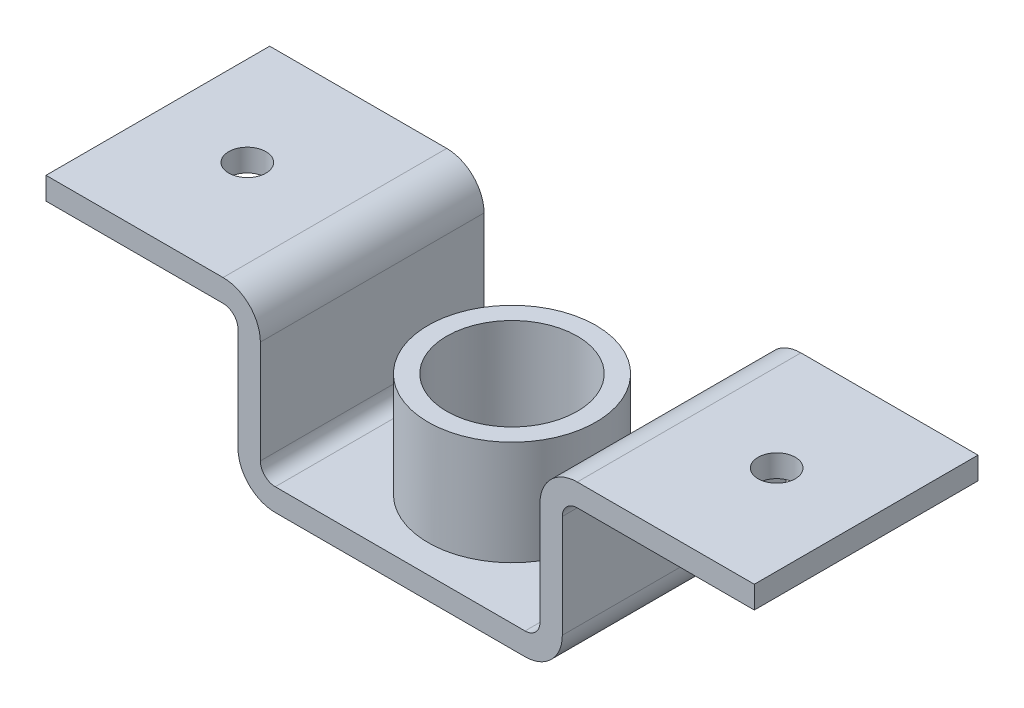
ISO-10303-21;
HEADER;
FILE_DESCRIPTION(('STEP AP214'),'2;1');
FILE_NAME('part.step','',(''),(''),'','','');
FILE_SCHEMA(('AUTOMOTIVE_DESIGN { 1 0 10303 214 1 1 1 1 }'));
ENDSEC;
DATA;
#1=APPLICATION_CONTEXT('core data for automotive mechanical design processes');
#2=APPLICATION_PROTOCOL_DEFINITION('international standard','automotive_design',2000,#1);
#3=PRODUCT_CONTEXT('',#1,'mechanical');
#4=PRODUCT('Part','Part','',(#3));
#5=PRODUCT_RELATED_PRODUCT_CATEGORY('part','',(#4));
#6=PRODUCT_DEFINITION_FORMATION('','',#4);
#7=PRODUCT_DEFINITION_CONTEXT('part definition',#1,'design');
#8=PRODUCT_DEFINITION('design','',#6,#7);
#9=PRODUCT_DEFINITION_SHAPE('','',#8);
#10=(LENGTH_UNIT() NAMED_UNIT(*) SI_UNIT(.MILLI.,.METRE.));
#11=(NAMED_UNIT(*) PLANE_ANGLE_UNIT() SI_UNIT($,.RADIAN.));
#12=(NAMED_UNIT(*) SI_UNIT($,.STERADIAN.) SOLID_ANGLE_UNIT());
#13=UNCERTAINTY_MEASURE_WITH_UNIT(LENGTH_MEASURE(1.E-05),#10,'distance_accuracy_value','');
#14=(GEOMETRIC_REPRESENTATION_CONTEXT(3) GLOBAL_UNCERTAINTY_ASSIGNED_CONTEXT((#13)) GLOBAL_UNIT_ASSIGNED_CONTEXT((#10,
#11,#12)) REPRESENTATION_CONTEXT('',''));
#15=CARTESIAN_POINT('',(0.,0.,0.));
#16=DIRECTION('',(0.,0.,1.));
#17=DIRECTION('',(1.,0.,0.));
#18=AXIS2_PLACEMENT_3D('',#15,#16,#17);
#19=CARTESIAN_POINT('',(167.5,49.9999999999999,300.));
#20=DIRECTION('',(0.,0.,-1.));
#21=DIRECTION('',(-1.,0.,0.));
#22=AXIS2_PLACEMENT_3D('',#19,#20,#21);
#23=CYLINDRICAL_SURFACE('',#22,20.);
#24=CARTESIAN_POINT('',(167.5,49.9999999999999,0.));
#25=DIRECTION('',(0.,0.,-1.));
#26=DIRECTION('',(-1.,0.,0.));
#27=AXIS2_PLACEMENT_3D('',#24,#25,#26);
#28=CIRCLE('',#27,20.);
#29=CARTESIAN_POINT('',(187.5,50.0000000000001,0.));
#30=VERTEX_POINT('',#29);
#31=CARTESIAN_POINT('',(167.5,29.9999999999999,0.));
#32=VERTEX_POINT('',#31);
#33=EDGE_CURVE('E208',#30,#32,#28,.T.);
#34=ORIENTED_EDGE('',*,*,#33,.T.);
#35=DIRECTION('',(0.,0.,-1.));
#36=VECTOR('',#35,1.);
#37=CARTESIAN_POINT('',(167.5,29.9999999999999,300.));
#38=LINE('',#37,#36);
#39=CARTESIAN_POINT('',(167.5,29.9999999999999,300.));
#40=VERTEX_POINT('',#39);
#41=EDGE_CURVE('E46',#40,#32,#38,.T.);
#42=ORIENTED_EDGE('',*,*,#41,.F.);
#43=CARTESIAN_POINT('',(167.5,49.9999999999999,300.));
#44=DIRECTION('',(0.,0.,-1.));
#45=DIRECTION('',(-1.,0.,0.));
#46=AXIS2_PLACEMENT_3D('',#43,#44,#45);
#47=CIRCLE('',#46,20.);
#48=CARTESIAN_POINT('',(187.5,50.0000000000001,300.));
#49=VERTEX_POINT('',#48);
#50=EDGE_CURVE('E247',#49,#40,#47,.T.);
#51=ORIENTED_EDGE('',*,*,#50,.F.);
#52=DIRECTION('',(0.,0.,-1.));
#53=VECTOR('',#52,1.);
#54=CARTESIAN_POINT('',(187.5,50.0000000000001,300.));
#55=LINE('',#54,#53);
#56=EDGE_CURVE('E204',#49,#30,#55,.T.);
#57=ORIENTED_EDGE('',*,*,#56,.T.);
#58=EDGE_LOOP('',(#34,#42,#51,#57));
#59=FACE_BOUND('',#58,.T.);
#60=ADVANCED_FACE('F37',(#59),#23,.F.);
#61=CARTESIAN_POINT('',(167.5,29.9999999999999,300.));
#62=DIRECTION('',(0.,-1.,0.));
#63=DIRECTION('',(0.,0.,-1.));
#64=AXIS2_PLACEMENT_3D('',#61,#62,#63);
#65=PLANE('',#64);
#66=CARTESIAN_POINT('',(0.,29.9999999999999,150.));
#67=DIRECTION('',(0.,-1.,0.));
#68=DIRECTION('',(0.,0.,-1.));
#69=AXIS2_PLACEMENT_3D('',#66,#67,#68);
#70=CIRCLE('',#69,112.5);
#71=CARTESIAN_POINT('',(0.,29.9999999999999,37.5));
#72=VERTEX_POINT('',#71);
#73=EDGE_CURVE('E11',#72,#72,#70,.F.);
#74=ORIENTED_EDGE('',*,*,#73,.F.);
#75=EDGE_LOOP('',(#74));
#76=FACE_BOUND('',#75,.T.);
#77=DIRECTION('',(-1.,0.,0.));
#78=VECTOR('',#77,1.);
#79=CARTESIAN_POINT('',(167.5,29.9999999999999,0.));
#80=LINE('',#79,#78);
#81=CARTESIAN_POINT('',(-167.5,29.9999999999999,0.));
#82=VERTEX_POINT('',#81);
#83=EDGE_CURVE('E211',#32,#82,#80,.T.);
#84=ORIENTED_EDGE('',*,*,#83,.T.);
#85=DIRECTION('',(0.,0.,-1.));
#86=VECTOR('',#85,1.);
#87=CARTESIAN_POINT('',(-167.5,29.9999999999999,300.));
#88=LINE('',#87,#86);
#89=CARTESIAN_POINT('',(-167.5,29.9999999999999,300.));
#90=VERTEX_POINT('',#89);
#91=EDGE_CURVE('E293',#90,#82,#88,.T.);
#92=ORIENTED_EDGE('',*,*,#91,.F.);
#93=DIRECTION('',(-1.,0.,0.));
#94=VECTOR('',#93,1.);
#95=CARTESIAN_POINT('',(167.5,29.9999999999999,300.));
#96=LINE('',#95,#94);
#97=EDGE_CURVE('E135',#40,#90,#96,.T.);
#98=ORIENTED_EDGE('',*,*,#97,.F.);
#99=ORIENTED_EDGE('',*,*,#41,.T.);
#100=EDGE_LOOP('',(#84,#92,#98,#99));
#101=FACE_BOUND('',#100,.T.);
#102=ADVANCED_FACE('F296',(#76,#101),#65,.F.);
#103=CARTESIAN_POINT('',(-167.5,49.9999999999999,300.));
#104=DIRECTION('',(0.,0.,-1.));
#105=DIRECTION('',(-1.,0.,0.));
#106=AXIS2_PLACEMENT_3D('',#103,#104,#105);
#107=CYLINDRICAL_SURFACE('',#106,20.);
#108=CARTESIAN_POINT('',(-167.5,49.9999999999999,0.));
#109=DIRECTION('',(0.,0.,-1.));
#110=DIRECTION('',(-1.,0.,0.));
#111=AXIS2_PLACEMENT_3D('',#108,#109,#110);
#112=CIRCLE('',#111,20.);
#113=CARTESIAN_POINT('',(-187.5,50.0000000000001,0.));
#114=VERTEX_POINT('',#113);
#115=EDGE_CURVE('E214',#82,#114,#112,.T.);
#116=ORIENTED_EDGE('',*,*,#115,.T.);
#117=DIRECTION('',(0.,0.,-1.));
#118=VECTOR('',#117,1.);
#119=CARTESIAN_POINT('',(-187.5,50.0000000000001,300.));
#120=LINE('',#119,#118);
#121=CARTESIAN_POINT('',(-187.5,50.0000000000001,300.));
#122=VERTEX_POINT('',#121);
#123=EDGE_CURVE('E290',#122,#114,#120,.T.);
#124=ORIENTED_EDGE('',*,*,#123,.F.);
#125=CARTESIAN_POINT('',(-167.5,49.9999999999999,300.));
#126=DIRECTION('',(0.,0.,-1.));
#127=DIRECTION('',(-1.,0.,0.));
#128=AXIS2_PLACEMENT_3D('',#125,#126,#127);
#129=CIRCLE('',#128,20.);
#130=EDGE_CURVE('E316',#90,#122,#129,.T.);
#131=ORIENTED_EDGE('',*,*,#130,.F.);
#132=ORIENTED_EDGE('',*,*,#91,.T.);
#133=EDGE_LOOP('',(#116,#124,#131,#132));
#134=FACE_BOUND('',#133,.T.);
#135=ADVANCED_FACE('F307',(#134),#107,.F.);
#136=CARTESIAN_POINT('',(-187.5,50.0000000000001,300.));
#137=DIRECTION('',(-1.,0.,0.));
#138=DIRECTION('',(0.,0.,1.));
#139=AXIS2_PLACEMENT_3D('',#136,#137,#138);
#140=PLANE('',#139);
#141=DIRECTION('',(0.,1.,0.));
#142=VECTOR('',#141,1.);
#143=CARTESIAN_POINT('',(-187.5,50.0000000000001,0.));
#144=LINE('',#143,#142);
#145=CARTESIAN_POINT('',(-187.5,188.,0.));
#146=VERTEX_POINT('',#145);
#147=EDGE_CURVE('E216',#114,#146,#144,.T.);
#148=ORIENTED_EDGE('',*,*,#147,.T.);
#149=DIRECTION('',(0.,0.,-1.));
#150=VECTOR('',#149,1.);
#151=CARTESIAN_POINT('',(-187.5,188.,300.));
#152=LINE('',#151,#150);
#153=CARTESIAN_POINT('',(-187.5,188.,300.));
#154=VERTEX_POINT('',#153);
#155=EDGE_CURVE('E287',#154,#146,#152,.T.);
#156=ORIENTED_EDGE('',*,*,#155,.F.);
#157=DIRECTION('',(0.,1.,0.));
#158=VECTOR('',#157,1.);
#159=CARTESIAN_POINT('',(-187.5,50.0000000000001,300.));
#160=LINE('',#159,#158);
#161=EDGE_CURVE('E313',#122,#154,#160,.T.);
#162=ORIENTED_EDGE('',*,*,#161,.F.);
#163=ORIENTED_EDGE('',*,*,#123,.T.);
#164=EDGE_LOOP('',(#148,#156,#162,#163));
#165=FACE_BOUND('',#164,.T.);
#166=ADVANCED_FACE('F311',(#165),#140,.F.);
#167=CARTESIAN_POINT('',(-237.5,188.,300.));
#168=DIRECTION('',(0.,0.,-1.));
#169=DIRECTION('',(-1.,0.,0.));
#170=AXIS2_PLACEMENT_3D('',#167,#168,#169);
#171=CYLINDRICAL_SURFACE('',#170,50.);
#172=CARTESIAN_POINT('',(-237.5,188.,0.));
#173=DIRECTION('',(0.,0.,1.));
#174=DIRECTION('',(1.,0.,0.));
#175=AXIS2_PLACEMENT_3D('',#172,#173,#174);
#176=CIRCLE('',#175,50.);
#177=CARTESIAN_POINT('',(-237.5,238.,0.));
#178=VERTEX_POINT('',#177);
#179=EDGE_CURVE('E218',#146,#178,#176,.T.);
#180=ORIENTED_EDGE('',*,*,#179,.T.);
#181=DIRECTION('',(0.,0.,-1.));
#182=VECTOR('',#181,1.);
#183=CARTESIAN_POINT('',(-237.5,238.,300.));
#184=LINE('',#183,#182);
#185=CARTESIAN_POINT('',(-237.5,238.,300.));
#186=VERTEX_POINT('',#185);
#187=EDGE_CURVE('E284',#186,#178,#184,.T.);
#188=ORIENTED_EDGE('',*,*,#187,.F.);
#189=CARTESIAN_POINT('',(-237.5,188.,300.));
#190=DIRECTION('',(0.,0.,1.));
#191=DIRECTION('',(1.,0.,0.));
#192=AXIS2_PLACEMENT_3D('',#189,#190,#191);
#193=CIRCLE('',#192,50.);
#194=EDGE_CURVE('E315',#154,#186,#193,.T.);
#195=ORIENTED_EDGE('',*,*,#194,.F.);
#196=ORIENTED_EDGE('',*,*,#155,.T.);
#197=EDGE_LOOP('',(#180,#188,#195,#196));
#198=FACE_BOUND('',#197,.T.);
#199=ADVANCED_FACE('F403',(#198),#171,.T.);
#200=CARTESIAN_POINT('',(-237.5,238.,300.));
#201=DIRECTION('',(0.,-1.,0.));
#202=DIRECTION('',(1.,0.,0.));
#203=AXIS2_PLACEMENT_3D('',#200,#201,#202);
#204=PLANE('',#203);
#205=CARTESIAN_POINT('',(-355.,238.,150.));
#206=DIRECTION('',(0.,1.,0.));
#207=DIRECTION('',(0.,0.,1.));
#208=AXIS2_PLACEMENT_3D('',#205,#206,#207);
#209=CIRCLE('',#208,25.);
#210=CARTESIAN_POINT('',(-355.,238.,175.));
#211=VERTEX_POINT('',#210);
#212=EDGE_CURVE('E456',#211,#211,#209,.T.);
#213=ORIENTED_EDGE('',*,*,#212,.F.);
#214=EDGE_LOOP('',(#213));
#215=FACE_BOUND('',#214,.T.);
#216=DIRECTION('',(-1.,0.,0.));
#217=VECTOR('',#216,1.);
#218=CARTESIAN_POINT('',(-237.5,238.,0.));
#219=LINE('',#218,#217);
#220=CARTESIAN_POINT('',(-475.,238.,0.));
#221=VERTEX_POINT('',#220);
#222=EDGE_CURVE('E220',#178,#221,#219,.T.);
#223=ORIENTED_EDGE('',*,*,#222,.T.);
#224=DIRECTION('',(0.,0.,-1.));
#225=VECTOR('',#224,1.);
#226=CARTESIAN_POINT('',(-475.,238.,300.));
#227=LINE('',#226,#225);
#228=CARTESIAN_POINT('',(-475.,238.,300.));
#229=VERTEX_POINT('',#228);
#230=EDGE_CURVE('E281',#229,#221,#227,.T.);
#231=ORIENTED_EDGE('',*,*,#230,.F.);
#232=DIRECTION('',(-1.,0.,0.));
#233=VECTOR('',#232,1.);
#234=CARTESIAN_POINT('',(-237.5,238.,300.));
#235=LINE('',#234,#233);
#236=EDGE_CURVE('E318',#186,#229,#235,.T.);
#237=ORIENTED_EDGE('',*,*,#236,.F.);
#238=ORIENTED_EDGE('',*,*,#187,.T.);
#239=EDGE_LOOP('',(#223,#231,#237,#238));
#240=FACE_BOUND('',#239,.T.);
#241=ADVANCED_FACE('F399',(#215,#240),#204,.F.);
#242=CARTESIAN_POINT('',(-475.,238.,300.));
#243=DIRECTION('',(1.,0.,0.));
#244=DIRECTION('',(0.,0.,-1.));
#245=AXIS2_PLACEMENT_3D('',#242,#243,#244);
#246=PLANE('',#245);
#247=DIRECTION('',(0.,-1.,0.));
#248=VECTOR('',#247,1.);
#249=CARTESIAN_POINT('',(-475.,238.,0.));
#250=LINE('',#249,#248);
#251=CARTESIAN_POINT('',(-475.,208.,0.));
#252=VERTEX_POINT('',#251);
#253=EDGE_CURVE('E222',#221,#252,#250,.T.);
#254=ORIENTED_EDGE('',*,*,#253,.T.);
#255=DIRECTION('',(0.,0.,-1.));
#256=VECTOR('',#255,1.);
#257=CARTESIAN_POINT('',(-475.,208.,300.));
#258=LINE('',#257,#256);
#259=CARTESIAN_POINT('',(-475.,208.,300.));
#260=VERTEX_POINT('',#259);
#261=EDGE_CURVE('E278',#260,#252,#258,.T.);
#262=ORIENTED_EDGE('',*,*,#261,.F.);
#263=DIRECTION('',(0.,-1.,0.));
#264=VECTOR('',#263,1.);
#265=CARTESIAN_POINT('',(-475.,238.,300.));
#266=LINE('',#265,#264);
#267=EDGE_CURVE('E324',#229,#260,#266,.T.);
#268=ORIENTED_EDGE('',*,*,#267,.F.);
#269=ORIENTED_EDGE('',*,*,#230,.T.);
#270=EDGE_LOOP('',(#254,#262,#268,#269));
#271=FACE_BOUND('',#270,.T.);
#272=ADVANCED_FACE('F395',(#271),#246,.F.);
#273=CARTESIAN_POINT('',(-475.,208.,300.));
#274=DIRECTION('',(0.,1.,0.));
#275=DIRECTION('',(0.,0.,1.));
#276=AXIS2_PLACEMENT_3D('',#273,#274,#275);
#277=PLANE('',#276);
#278=CARTESIAN_POINT('',(-355.,208.,150.));
#279=DIRECTION('',(0.,1.,0.));
#280=DIRECTION('',(0.,0.,1.));
#281=AXIS2_PLACEMENT_3D('',#278,#279,#280);
#282=CIRCLE('',#281,25.);
#283=CARTESIAN_POINT('',(-355.,208.,175.));
#284=VERTEX_POINT('',#283);
#285=EDGE_CURVE('E463',#284,#284,#282,.T.);
#286=ORIENTED_EDGE('',*,*,#285,.T.);
#287=EDGE_LOOP('',(#286));
#288=FACE_BOUND('',#287,.T.);
#289=DIRECTION('',(1.,0.,0.));
#290=VECTOR('',#289,1.);
#291=CARTESIAN_POINT('',(-475.,208.,0.));
#292=LINE('',#291,#290);
#293=CARTESIAN_POINT('',(-237.5,208.,0.));
#294=VERTEX_POINT('',#293);
#295=EDGE_CURVE('E224',#252,#294,#292,.T.);
#296=ORIENTED_EDGE('',*,*,#295,.T.);
#297=DIRECTION('',(0.,0.,-1.));
#298=VECTOR('',#297,1.);
#299=CARTESIAN_POINT('',(-237.5,208.,300.));
#300=LINE('',#299,#298);
#301=CARTESIAN_POINT('',(-237.5,208.,300.));
#302=VERTEX_POINT('',#301);
#303=EDGE_CURVE('E275',#302,#294,#300,.T.);
#304=ORIENTED_EDGE('',*,*,#303,.F.);
#305=DIRECTION('',(1.,0.,0.));
#306=VECTOR('',#305,1.);
#307=CARTESIAN_POINT('',(-475.,208.,300.));
#308=LINE('',#307,#306);
#309=EDGE_CURVE('E326',#260,#302,#308,.T.);
#310=ORIENTED_EDGE('',*,*,#309,.F.);
#311=ORIENTED_EDGE('',*,*,#261,.T.);
#312=EDGE_LOOP('',(#296,#304,#310,#311));
#313=FACE_BOUND('',#312,.T.);
#314=ADVANCED_FACE('F391',(#288,#313),#277,.F.);
#315=CARTESIAN_POINT('',(-237.5,188.,300.));
#316=DIRECTION('',(0.,0.,-1.));
#317=DIRECTION('',(-1.,0.,0.));
#318=AXIS2_PLACEMENT_3D('',#315,#316,#317);
#319=CYLINDRICAL_SURFACE('',#318,20.);
#320=CARTESIAN_POINT('',(-237.5,188.,0.));
#321=DIRECTION('',(0.,0.,-1.));
#322=DIRECTION('',(-1.,0.,0.));
#323=AXIS2_PLACEMENT_3D('',#320,#321,#322);
#324=CIRCLE('',#323,20.);
#325=CARTESIAN_POINT('',(-217.5,188.,0.));
#326=VERTEX_POINT('',#325);
#327=EDGE_CURVE('E226',#294,#326,#324,.T.);
#328=ORIENTED_EDGE('',*,*,#327,.T.);
#329=DIRECTION('',(0.,0.,-1.));
#330=VECTOR('',#329,1.);
#331=CARTESIAN_POINT('',(-217.5,188.,300.));
#332=LINE('',#331,#330);
#333=CARTESIAN_POINT('',(-217.5,188.,300.));
#334=VERTEX_POINT('',#333);
#335=EDGE_CURVE('E272',#334,#326,#332,.T.);
#336=ORIENTED_EDGE('',*,*,#335,.F.);
#337=CARTESIAN_POINT('',(-237.5,188.,300.));
#338=DIRECTION('',(0.,0.,-1.));
#339=DIRECTION('',(-1.,0.,0.));
#340=AXIS2_PLACEMENT_3D('',#337,#338,#339);
#341=CIRCLE('',#340,20.);
#342=EDGE_CURVE('E328',#302,#334,#341,.T.);
#343=ORIENTED_EDGE('',*,*,#342,.F.);
#344=ORIENTED_EDGE('',*,*,#303,.T.);
#345=EDGE_LOOP('',(#328,#336,#343,#344));
#346=FACE_BOUND('',#345,.T.);
#347=ADVANCED_FACE('F386',(#346),#319,.F.);
#348=CARTESIAN_POINT('',(-217.5,188.,300.));
#349=DIRECTION('',(1.,0.,0.));
#350=DIRECTION('',(0.,1.,0.));
#351=AXIS2_PLACEMENT_3D('',#348,#349,#350);
#352=PLANE('',#351);
#353=DIRECTION('',(0.,-1.,0.));
#354=VECTOR('',#353,1.);
#355=CARTESIAN_POINT('',(-217.5,188.,0.));
#356=LINE('',#355,#354);
#357=CARTESIAN_POINT('',(-217.5,50.,0.));
#358=VERTEX_POINT('',#357);
#359=EDGE_CURVE('E228',#326,#358,#356,.T.);
#360=ORIENTED_EDGE('',*,*,#359,.T.);
#361=DIRECTION('',(0.,0.,-1.));
#362=VECTOR('',#361,1.);
#363=CARTESIAN_POINT('',(-217.5,50.,300.));
#364=LINE('',#363,#362);
#365=CARTESIAN_POINT('',(-217.5,50.,300.));
#366=VERTEX_POINT('',#365);
#367=EDGE_CURVE('E269',#366,#358,#364,.T.);
#368=ORIENTED_EDGE('',*,*,#367,.F.);
#369=DIRECTION('',(0.,-1.,0.));
#370=VECTOR('',#369,1.);
#371=CARTESIAN_POINT('',(-217.5,188.,300.));
#372=LINE('',#371,#370);
#373=EDGE_CURVE('E330',#334,#366,#372,.T.);
#374=ORIENTED_EDGE('',*,*,#373,.F.);
#375=ORIENTED_EDGE('',*,*,#335,.T.);
#376=EDGE_LOOP('',(#360,#368,#374,#375));
#377=FACE_BOUND('',#376,.T.);
#378=ADVANCED_FACE('F380',(#377),#352,.F.);
#379=CARTESIAN_POINT('',(-167.5,50.,300.));
#380=DIRECTION('',(0.,0.,-1.));
#381=DIRECTION('',(-1.,0.,0.));
#382=AXIS2_PLACEMENT_3D('',#379,#380,#381);
#383=CYLINDRICAL_SURFACE('',#382,50.);
#384=CARTESIAN_POINT('',(-167.5,50.,0.));
#385=DIRECTION('',(0.,0.,1.));
#386=DIRECTION('',(-1.,0.,0.));
#387=AXIS2_PLACEMENT_3D('',#384,#385,#386);
#388=CIRCLE('',#387,50.);
#389=CARTESIAN_POINT('',(-167.5,0.,0.));
#390=VERTEX_POINT('',#389);
#391=EDGE_CURVE('E230',#358,#390,#388,.T.);
#392=ORIENTED_EDGE('',*,*,#391,.T.);
#393=DIRECTION('',(0.,0.,-1.));
#394=VECTOR('',#393,1.);
#395=CARTESIAN_POINT('',(-167.5,0.,300.));
#396=LINE('',#395,#394);
#397=CARTESIAN_POINT('',(-167.5,0.,300.));
#398=VERTEX_POINT('',#397);
#399=EDGE_CURVE('E266',#398,#390,#396,.T.);
#400=ORIENTED_EDGE('',*,*,#399,.F.);
#401=CARTESIAN_POINT('',(-167.5,50.,300.));
#402=DIRECTION('',(0.,0.,1.));
#403=DIRECTION('',(-1.,0.,0.));
#404=AXIS2_PLACEMENT_3D('',#401,#402,#403);
#405=CIRCLE('',#404,50.);
#406=EDGE_CURVE('E332',#366,#398,#405,.T.);
#407=ORIENTED_EDGE('',*,*,#406,.F.);
#408=ORIENTED_EDGE('',*,*,#367,.T.);
#409=EDGE_LOOP('',(#392,#400,#407,#408));
#410=FACE_BOUND('',#409,.T.);
#411=ADVANCED_FACE('F376',(#410),#383,.T.);
#412=CARTESIAN_POINT('',(-167.5,0.,300.));
#413=DIRECTION('',(0.,1.,0.));
#414=DIRECTION('',(0.,0.,1.));
#415=AXIS2_PLACEMENT_3D('',#412,#413,#414);
#416=PLANE('',#415);
#417=CARTESIAN_POINT('',(0.,0.,150.));
#418=DIRECTION('',(0.,1.,0.));
#419=DIRECTION('',(0.,0.,1.));
#420=AXIS2_PLACEMENT_3D('',#417,#418,#419);
#421=CIRCLE('',#420,37.5);
#422=CARTESIAN_POINT('',(0.,0.,187.5));
#423=VERTEX_POINT('',#422);
#424=EDGE_CURVE('E453',#423,#423,#421,.T.);
#425=ORIENTED_EDGE('',*,*,#424,.T.);
#426=EDGE_LOOP('',(#425));
#427=FACE_BOUND('',#426,.T.);
#428=DIRECTION('',(1.,0.,0.));
#429=VECTOR('',#428,1.);
#430=CARTESIAN_POINT('',(-167.5,0.,0.));
#431=LINE('',#430,#429);
#432=CARTESIAN_POINT('',(167.5,0.,0.));
#433=VERTEX_POINT('',#432);
#434=EDGE_CURVE('E232',#390,#433,#431,.T.);
#435=ORIENTED_EDGE('',*,*,#434,.T.);
#436=DIRECTION('',(0.,0.,-1.));
#437=VECTOR('',#436,1.);
#438=CARTESIAN_POINT('',(167.5,0.,300.));
#439=LINE('',#438,#437);
#440=CARTESIAN_POINT('',(167.5,0.,300.));
#441=VERTEX_POINT('',#440);
#442=EDGE_CURVE('E263',#441,#433,#439,.T.);
#443=ORIENTED_EDGE('',*,*,#442,.F.);
#444=DIRECTION('',(1.,0.,0.));
#445=VECTOR('',#444,1.);
#446=CARTESIAN_POINT('',(-167.5,0.,300.));
#447=LINE('',#446,#445);
#448=EDGE_CURVE('E334',#398,#441,#447,.T.);
#449=ORIENTED_EDGE('',*,*,#448,.F.);
#450=ORIENTED_EDGE('',*,*,#399,.T.);
#451=EDGE_LOOP('',(#435,#443,#449,#450));
#452=FACE_BOUND('',#451,.T.);
#453=ADVANCED_FACE('F371',(#427,#452),#416,.F.);
#454=CARTESIAN_POINT('',(167.5,50.,300.));
#455=DIRECTION('',(0.,0.,-1.));
#456=DIRECTION('',(-1.,0.,0.));
#457=AXIS2_PLACEMENT_3D('',#454,#455,#456);
#458=CYLINDRICAL_SURFACE('',#457,50.);
#459=CARTESIAN_POINT('',(167.5,50.,0.));
#460=DIRECTION('',(0.,0.,1.));
#461=DIRECTION('',(1.,0.,0.));
#462=AXIS2_PLACEMENT_3D('',#459,#460,#461);
#463=CIRCLE('',#462,50.);
#464=CARTESIAN_POINT('',(217.5,50.0000000000003,0.));
#465=VERTEX_POINT('',#464);
#466=EDGE_CURVE('E234',#433,#465,#463,.T.);
#467=ORIENTED_EDGE('',*,*,#466,.T.);
#468=DIRECTION('',(0.,0.,-1.));
#469=VECTOR('',#468,1.);
#470=CARTESIAN_POINT('',(217.5,50.0000000000003,300.));
#471=LINE('',#470,#469);
#472=CARTESIAN_POINT('',(217.5,50.0000000000003,300.));
#473=VERTEX_POINT('',#472);
#474=EDGE_CURVE('E260',#473,#465,#471,.T.);
#475=ORIENTED_EDGE('',*,*,#474,.F.);
#476=CARTESIAN_POINT('',(167.5,50.,300.));
#477=DIRECTION('',(0.,0.,1.));
#478=DIRECTION('',(1.,0.,0.));
#479=AXIS2_PLACEMENT_3D('',#476,#477,#478);
#480=CIRCLE('',#479,50.);
#481=EDGE_CURVE('E336',#441,#473,#480,.T.);
#482=ORIENTED_EDGE('',*,*,#481,.F.);
#483=ORIENTED_EDGE('',*,*,#442,.T.);
#484=EDGE_LOOP('',(#467,#475,#482,#483));
#485=FACE_BOUND('',#484,.T.);
#486=ADVANCED_FACE('F365',(#485),#458,.T.);
#487=CARTESIAN_POINT('',(217.5,50.0000000000003,300.));
#488=DIRECTION('',(-1.,0.,0.));
#489=DIRECTION('',(0.,-1.,0.));
#490=AXIS2_PLACEMENT_3D('',#487,#488,#489);
#491=PLANE('',#490);
#492=DIRECTION('',(0.,1.,0.));
#493=VECTOR('',#492,1.);
#494=CARTESIAN_POINT('',(217.5,50.0000000000003,0.));
#495=LINE('',#494,#493);
#496=CARTESIAN_POINT('',(217.5,188.,0.));
#497=VERTEX_POINT('',#496);
#498=EDGE_CURVE('E236',#465,#497,#495,.T.);
#499=ORIENTED_EDGE('',*,*,#498,.T.);
#500=DIRECTION('',(0.,0.,-1.));
#501=VECTOR('',#500,1.);
#502=CARTESIAN_POINT('',(217.5,188.,300.));
#503=LINE('',#502,#501);
#504=CARTESIAN_POINT('',(217.5,188.,300.));
#505=VERTEX_POINT('',#504);
#506=EDGE_CURVE('E257',#505,#497,#503,.T.);
#507=ORIENTED_EDGE('',*,*,#506,.F.);
#508=DIRECTION('',(0.,1.,0.));
#509=VECTOR('',#508,1.);
#510=CARTESIAN_POINT('',(217.5,50.0000000000003,300.));
#511=LINE('',#510,#509);
#512=EDGE_CURVE('E338',#473,#505,#511,.T.);
#513=ORIENTED_EDGE('',*,*,#512,.F.);
#514=ORIENTED_EDGE('',*,*,#474,.T.);
#515=EDGE_LOOP('',(#499,#507,#513,#514));
#516=FACE_BOUND('',#515,.T.);
#517=ADVANCED_FACE('F361',(#516),#491,.F.);
#518=CARTESIAN_POINT('',(237.5,188.,300.));
#519=DIRECTION('',(0.,0.,-1.));
#520=DIRECTION('',(-1.,0.,0.));
#521=AXIS2_PLACEMENT_3D('',#518,#519,#520);
#522=CYLINDRICAL_SURFACE('',#521,20.);
#523=CARTESIAN_POINT('',(237.5,188.,0.));
#524=DIRECTION('',(0.,0.,-1.));
#525=DIRECTION('',(-1.,0.,0.));
#526=AXIS2_PLACEMENT_3D('',#523,#524,#525);
#527=CIRCLE('',#526,20.);
#528=CARTESIAN_POINT('',(237.5,208.,0.));
#529=VERTEX_POINT('',#528);
#530=EDGE_CURVE('E238',#497,#529,#527,.T.);
#531=ORIENTED_EDGE('',*,*,#530,.T.);
#532=DIRECTION('',(0.,0.,-1.));
#533=VECTOR('',#532,1.);
#534=CARTESIAN_POINT('',(237.5,208.,300.));
#535=LINE('',#534,#533);
#536=CARTESIAN_POINT('',(237.5,208.,300.));
#537=VERTEX_POINT('',#536);
#538=EDGE_CURVE('E254',#537,#529,#535,.T.);
#539=ORIENTED_EDGE('',*,*,#538,.F.);
#540=CARTESIAN_POINT('',(237.5,188.,300.));
#541=DIRECTION('',(0.,0.,-1.));
#542=DIRECTION('',(-1.,0.,0.));
#543=AXIS2_PLACEMENT_3D('',#540,#541,#542);
#544=CIRCLE('',#543,20.);
#545=EDGE_CURVE('E340',#505,#537,#544,.T.);
#546=ORIENTED_EDGE('',*,*,#545,.F.);
#547=ORIENTED_EDGE('',*,*,#506,.T.);
#548=EDGE_LOOP('',(#531,#539,#546,#547));
#549=FACE_BOUND('',#548,.T.);
#550=ADVANCED_FACE('F357',(#549),#522,.F.);
#551=CARTESIAN_POINT('',(237.5,208.,300.));
#552=DIRECTION('',(0.,1.,0.));
#553=DIRECTION('',(0.,0.,1.));
#554=AXIS2_PLACEMENT_3D('',#551,#552,#553);
#555=PLANE('',#554);
#556=CARTESIAN_POINT('',(355.,208.,150.));
#557=DIRECTION('',(0.,1.,0.));
#558=DIRECTION('',(0.,0.,1.));
#559=AXIS2_PLACEMENT_3D('',#556,#557,#558);
#560=CIRCLE('',#559,25.);
#561=CARTESIAN_POINT('',(355.,208.,175.));
#562=VERTEX_POINT('',#561);
#563=EDGE_CURVE('E460',#562,#562,#560,.T.);
#564=ORIENTED_EDGE('',*,*,#563,.T.);
#565=EDGE_LOOP('',(#564));
#566=FACE_BOUND('',#565,.T.);
#567=DIRECTION('',(1.,0.,0.));
#568=VECTOR('',#567,1.);
#569=CARTESIAN_POINT('',(237.5,208.,0.));
#570=LINE('',#569,#568);
#571=CARTESIAN_POINT('',(475.,208.,0.));
#572=VERTEX_POINT('',#571);
#573=EDGE_CURVE('E240',#529,#572,#570,.T.);
#574=ORIENTED_EDGE('',*,*,#573,.T.);
#575=DIRECTION('',(0.,0.,-1.));
#576=VECTOR('',#575,1.);
#577=CARTESIAN_POINT('',(475.,208.,300.));
#578=LINE('',#577,#576);
#579=CARTESIAN_POINT('',(475.,208.,300.));
#580=VERTEX_POINT('',#579);
#581=EDGE_CURVE('E251',#580,#572,#578,.T.);
#582=ORIENTED_EDGE('',*,*,#581,.F.);
#583=DIRECTION('',(1.,0.,0.));
#584=VECTOR('',#583,1.);
#585=CARTESIAN_POINT('',(237.5,208.,300.));
#586=LINE('',#585,#584);
#587=EDGE_CURVE('E342',#537,#580,#586,.T.);
#588=ORIENTED_EDGE('',*,*,#587,.F.);
#589=ORIENTED_EDGE('',*,*,#538,.T.);
#590=EDGE_LOOP('',(#574,#582,#588,#589));
#591=FACE_BOUND('',#590,.T.);
#592=ADVANCED_FACE('F348',(#566,#591),#555,.F.);
#593=CARTESIAN_POINT('',(475.,208.,300.));
#594=DIRECTION('',(-1.,0.,0.));
#595=DIRECTION('',(0.,0.,1.));
#596=AXIS2_PLACEMENT_3D('',#593,#594,#595);
#597=PLANE('',#596);
#598=DIRECTION('',(0.,1.,0.));
#599=VECTOR('',#598,1.);
#600=CARTESIAN_POINT('',(475.,208.,0.));
#601=LINE('',#600,#599);
#602=CARTESIAN_POINT('',(475.,238.,0.));
#603=VERTEX_POINT('',#602);
#604=EDGE_CURVE('E242',#572,#603,#601,.T.);
#605=ORIENTED_EDGE('',*,*,#604,.T.);
#606=DIRECTION('',(0.,0.,-1.));
#607=VECTOR('',#606,1.);
#608=CARTESIAN_POINT('',(475.,238.,300.));
#609=LINE('',#608,#607);
#610=CARTESIAN_POINT('',(475.,238.,300.));
#611=VERTEX_POINT('',#610);
#612=EDGE_CURVE('E199',#611,#603,#609,.T.);
#613=ORIENTED_EDGE('',*,*,#612,.F.);
#614=DIRECTION('',(0.,1.,0.));
#615=VECTOR('',#614,1.);
#616=CARTESIAN_POINT('',(475.,208.,300.));
#617=LINE('',#616,#615);
#618=EDGE_CURVE('E190',#580,#611,#617,.T.);
#619=ORIENTED_EDGE('',*,*,#618,.F.);
#620=ORIENTED_EDGE('',*,*,#581,.T.);
#621=EDGE_LOOP('',(#605,#613,#619,#620));
#622=FACE_BOUND('',#621,.T.);
#623=ADVANCED_FACE('F352',(#622),#597,.F.);
#624=CARTESIAN_POINT('',(475.,238.,300.));
#625=DIRECTION('',(0.,-1.,0.));
#626=DIRECTION('',(1.,0.,0.));
#627=AXIS2_PLACEMENT_3D('',#624,#625,#626);
#628=PLANE('',#627);
#629=CARTESIAN_POINT('',(355.,238.,150.));
#630=DIRECTION('',(0.,1.,0.));
#631=DIRECTION('',(0.,0.,1.));
#632=AXIS2_PLACEMENT_3D('',#629,#630,#631);
#633=CIRCLE('',#632,25.);
#634=CARTESIAN_POINT('',(355.,238.,175.));
#635=VERTEX_POINT('',#634);
#636=EDGE_CURVE('E457',#635,#635,#633,.T.);
#637=ORIENTED_EDGE('',*,*,#636,.F.);
#638=EDGE_LOOP('',(#637));
#639=FACE_BOUND('',#638,.T.);
#640=DIRECTION('',(-1.,0.,0.));
#641=VECTOR('',#640,1.);
#642=CARTESIAN_POINT('',(475.,238.,0.));
#643=LINE('',#642,#641);
#644=CARTESIAN_POINT('',(237.5,238.,0.));
#645=VERTEX_POINT('',#644);
#646=EDGE_CURVE('E198',#603,#645,#643,.T.);
#647=ORIENTED_EDGE('',*,*,#646,.T.);
#648=DIRECTION('',(0.,0.,-1.));
#649=VECTOR('',#648,1.);
#650=CARTESIAN_POINT('',(237.5,238.,300.));
#651=LINE('',#650,#649);
#652=CARTESIAN_POINT('',(237.5,238.,300.));
#653=VERTEX_POINT('',#652);
#654=EDGE_CURVE('E195',#653,#645,#651,.T.);
#655=ORIENTED_EDGE('',*,*,#654,.F.);
#656=DIRECTION('',(-1.,0.,0.));
#657=VECTOR('',#656,1.);
#658=CARTESIAN_POINT('',(475.,238.,300.));
#659=LINE('',#658,#657);
#660=EDGE_CURVE('E184',#611,#653,#659,.T.);
#661=ORIENTED_EDGE('',*,*,#660,.F.);
#662=ORIENTED_EDGE('',*,*,#612,.T.);
#663=EDGE_LOOP('',(#647,#655,#661,#662));
#664=FACE_BOUND('',#663,.T.);
#665=ADVANCED_FACE('F196',(#639,#664),#628,.F.);
#666=CARTESIAN_POINT('',(237.5,188.,300.));
#667=DIRECTION('',(0.,0.,-1.));
#668=DIRECTION('',(-1.,0.,0.));
#669=AXIS2_PLACEMENT_3D('',#666,#667,#668);
#670=CYLINDRICAL_SURFACE('',#669,50.);
#671=CARTESIAN_POINT('',(237.5,188.,0.));
#672=DIRECTION('',(0.,0.,1.));
#673=DIRECTION('',(1.,0.,0.));
#674=AXIS2_PLACEMENT_3D('',#671,#672,#673);
#675=CIRCLE('',#674,50.);
#676=CARTESIAN_POINT('',(187.5,188.,0.));
#677=VERTEX_POINT('',#676);
#678=EDGE_CURVE('E120',#645,#677,#675,.T.);
#679=ORIENTED_EDGE('',*,*,#678,.T.);
#680=DIRECTION('',(0.,0.,-1.));
#681=VECTOR('',#680,1.);
#682=CARTESIAN_POINT('',(187.5,188.,300.));
#683=LINE('',#682,#681);
#684=CARTESIAN_POINT('',(187.5,188.,300.));
#685=VERTEX_POINT('',#684);
#686=EDGE_CURVE('E200',#685,#677,#683,.T.);
#687=ORIENTED_EDGE('',*,*,#686,.F.);
#688=CARTESIAN_POINT('',(237.5,188.,300.));
#689=DIRECTION('',(0.,0.,1.));
#690=DIRECTION('',(1.,0.,0.));
#691=AXIS2_PLACEMENT_3D('',#688,#689,#690);
#692=CIRCLE('',#691,50.);
#693=EDGE_CURVE('E188',#653,#685,#692,.T.);
#694=ORIENTED_EDGE('',*,*,#693,.F.);
#695=ORIENTED_EDGE('',*,*,#654,.T.);
#696=EDGE_LOOP('',(#679,#687,#694,#695));
#697=FACE_BOUND('',#696,.T.);
#698=ADVANCED_FACE('F202',(#697),#670,.T.);
#699=CARTESIAN_POINT('',(187.5,188.,300.));
#700=DIRECTION('',(1.,0.,0.));
#701=DIRECTION('',(0.,0.,-1.));
#702=AXIS2_PLACEMENT_3D('',#699,#700,#701);
#703=PLANE('',#702);
#704=DIRECTION('',(0.,-1.,0.));
#705=VECTOR('',#704,1.);
#706=CARTESIAN_POINT('',(187.5,188.,0.));
#707=LINE('',#706,#705);
#708=EDGE_CURVE('E126',#677,#30,#707,.T.);
#709=ORIENTED_EDGE('',*,*,#708,.T.);
#710=ORIENTED_EDGE('',*,*,#56,.F.);
#711=DIRECTION('',(0.,-1.,0.));
#712=VECTOR('',#711,1.);
#713=CARTESIAN_POINT('',(187.5,188.,300.));
#714=LINE('',#713,#712);
#715=EDGE_CURVE('E55',#685,#49,#714,.T.);
#716=ORIENTED_EDGE('',*,*,#715,.F.);
#717=ORIENTED_EDGE('',*,*,#686,.T.);
#718=EDGE_LOOP('',(#709,#710,#716,#717));
#719=FACE_BOUND('',#718,.T.);
#720=ADVANCED_FACE('F507',(#719),#703,.F.);
#721=CARTESIAN_POINT('',(167.5,49.9999999999999,300.));
#722=DIRECTION('',(0.,0.,-1.));
#723=DIRECTION('',(-1.,0.,0.));
#724=AXIS2_PLACEMENT_3D('',#721,#722,#723);
#725=PLANE('',#724);
#726=ORIENTED_EDGE('',*,*,#50,.T.);
#727=ORIENTED_EDGE('',*,*,#97,.T.);
#728=ORIENTED_EDGE('',*,*,#130,.T.);
#729=ORIENTED_EDGE('',*,*,#161,.T.);
#730=ORIENTED_EDGE('',*,*,#194,.T.);
#731=ORIENTED_EDGE('',*,*,#236,.T.);
#732=ORIENTED_EDGE('',*,*,#267,.T.);
#733=ORIENTED_EDGE('',*,*,#309,.T.);
#734=ORIENTED_EDGE('',*,*,#342,.T.);
#735=ORIENTED_EDGE('',*,*,#373,.T.);
#736=ORIENTED_EDGE('',*,*,#406,.T.);
#737=ORIENTED_EDGE('',*,*,#448,.T.);
#738=ORIENTED_EDGE('',*,*,#481,.T.);
#739=ORIENTED_EDGE('',*,*,#512,.T.);
#740=ORIENTED_EDGE('',*,*,#545,.T.);
#741=ORIENTED_EDGE('',*,*,#587,.T.);
#742=ORIENTED_EDGE('',*,*,#618,.T.);
#743=ORIENTED_EDGE('',*,*,#660,.T.);
#744=ORIENTED_EDGE('',*,*,#693,.T.);
#745=ORIENTED_EDGE('',*,*,#715,.T.);
#746=EDGE_LOOP('',(#726,#727,#728,#729,#730,#731,#732,#733,#734,#735,#736,#737,#738,#739,#740,
#741,#742,#743,#744,#745));
#747=FACE_BOUND('',#746,.T.);
#748=ADVANCED_FACE('F186',(#747),#725,.F.);
#749=CARTESIAN_POINT('',(167.5,49.9999999999999,0.));
#750=DIRECTION('',(0.,0.,-1.));
#751=DIRECTION('',(-1.,0.,0.));
#752=AXIS2_PLACEMENT_3D('',#749,#750,#751);
#753=PLANE('',#752);
#754=ORIENTED_EDGE('',*,*,#33,.F.);
#755=ORIENTED_EDGE('',*,*,#708,.F.);
#756=ORIENTED_EDGE('',*,*,#678,.F.);
#757=ORIENTED_EDGE('',*,*,#646,.F.);
#758=ORIENTED_EDGE('',*,*,#604,.F.);
#759=ORIENTED_EDGE('',*,*,#573,.F.);
#760=ORIENTED_EDGE('',*,*,#530,.F.);
#761=ORIENTED_EDGE('',*,*,#498,.F.);
#762=ORIENTED_EDGE('',*,*,#466,.F.);
#763=ORIENTED_EDGE('',*,*,#434,.F.);
#764=ORIENTED_EDGE('',*,*,#391,.F.);
#765=ORIENTED_EDGE('',*,*,#359,.F.);
#766=ORIENTED_EDGE('',*,*,#327,.F.);
#767=ORIENTED_EDGE('',*,*,#295,.F.);
#768=ORIENTED_EDGE('',*,*,#253,.F.);
#769=ORIENTED_EDGE('',*,*,#222,.F.);
#770=ORIENTED_EDGE('',*,*,#179,.F.);
#771=ORIENTED_EDGE('',*,*,#147,.F.);
#772=ORIENTED_EDGE('',*,*,#115,.F.);
#773=ORIENTED_EDGE('',*,*,#83,.F.);
#774=EDGE_LOOP('',(#754,#755,#756,#757,#758,#759,#760,#761,#762,#763,#764,#765,#766,#767,#768,
#769,#770,#771,#772,#773));
#775=FACE_BOUND('',#774,.T.);
#776=ADVANCED_FACE('F301',(#775),#753,.T.);
#777=CARTESIAN_POINT('',(0.,170.,150.));
#778=DIRECTION('',(0.,-1.,0.));
#779=DIRECTION('',(0.,0.,-1.));
#780=AXIS2_PLACEMENT_3D('',#777,#778,#779);
#781=CYLINDRICAL_SURFACE('',#780,112.5);
#782=CARTESIAN_POINT('',(0.,170.,150.));
#783=DIRECTION('',(0.,1.,0.));
#784=DIRECTION('',(0.,0.,1.));
#785=AXIS2_PLACEMENT_3D('',#782,#783,#784);
#786=CIRCLE('',#785,112.5);
#787=CARTESIAN_POINT('',(0.,170.,262.5));
#788=VERTEX_POINT('',#787);
#789=EDGE_CURVE('E444',#788,#788,#786,.T.);
#790=ORIENTED_EDGE('',*,*,#789,.F.);
#791=EDGE_LOOP('',(#790));
#792=FACE_BOUND('',#791,.T.);
#793=ORIENTED_EDGE('',*,*,#73,.T.);
#794=EDGE_LOOP('',(#793));
#795=FACE_BOUND('',#794,.T.);
#796=ADVANCED_FACE('F512',(#792,#795),#781,.T.);
#797=CARTESIAN_POINT('',(0.,170.,150.));
#798=DIRECTION('',(0.,-1.,0.));
#799=DIRECTION('',(0.,0.,-1.));
#800=AXIS2_PLACEMENT_3D('',#797,#798,#799);
#801=CYLINDRICAL_SURFACE('',#800,87.5);
#802=CARTESIAN_POINT('',(0.,170.,150.));
#803=DIRECTION('',(0.,1.,0.));
#804=DIRECTION('',(0.,0.,1.));
#805=AXIS2_PLACEMENT_3D('',#802,#803,#804);
#806=CIRCLE('',#805,87.5);
#807=CARTESIAN_POINT('',(0.,170.,237.5));
#808=VERTEX_POINT('',#807);
#809=EDGE_CURVE('E447',#808,#808,#806,.T.);
#810=ORIENTED_EDGE('',*,*,#809,.T.);
#811=EDGE_LOOP('',(#810));
#812=FACE_BOUND('',#811,.T.);
#813=CARTESIAN_POINT('',(0.,29.9999999999999,150.));
#814=DIRECTION('',(0.,-1.,0.));
#815=DIRECTION('',(0.,0.,-1.));
#816=AXIS2_PLACEMENT_3D('',#813,#814,#815);
#817=CIRCLE('',#816,87.5);
#818=CARTESIAN_POINT('',(0.,29.9999999999999,62.5));
#819=VERTEX_POINT('',#818);
#820=EDGE_CURVE('E212',#819,#819,#817,.F.);
#821=ORIENTED_EDGE('',*,*,#820,.F.);
#822=EDGE_LOOP('',(#821));
#823=FACE_BOUND('',#822,.T.);
#824=ADVANCED_FACE('F435',(#812,#823),#801,.F.);
#825=CARTESIAN_POINT('',(0.,170.,150.));
#826=DIRECTION('',(0.,1.,0.));
#827=DIRECTION('',(0.,0.,1.));
#828=AXIS2_PLACEMENT_3D('',#825,#826,#827);
#829=PLANE('',#828);
#830=ORIENTED_EDGE('',*,*,#789,.T.);
#831=EDGE_LOOP('',(#830));
#832=FACE_BOUND('',#831,.T.);
#833=ORIENTED_EDGE('',*,*,#809,.F.);
#834=EDGE_LOOP('',(#833));
#835=FACE_BOUND('',#834,.T.);
#836=ADVANCED_FACE('F426',(#832,#835),#829,.T.);
#837=CARTESIAN_POINT('',(0.,29.9999999999999,150.));
#838=DIRECTION('',(0.,-1.,0.));
#839=DIRECTION('',(0.,0.,-1.));
#840=AXIS2_PLACEMENT_3D('',#837,#838,#839);
#841=CIRCLE('',#840,37.5);
#842=CARTESIAN_POINT('',(0.,29.9999999999999,112.5));
#843=VERTEX_POINT('',#842);
#844=EDGE_CURVE('E40',#843,#843,#841,.F.);
#845=ORIENTED_EDGE('',*,*,#844,.F.);
#846=EDGE_LOOP('',(#845));
#847=FACE_BOUND('',#846,.T.);
#848=ORIENTED_EDGE('',*,*,#820,.T.);
#849=EDGE_LOOP('',(#848));
#850=FACE_BOUND('',#849,.T.);
#851=ADVANCED_FACE('F418',(#847,#850),#65,.F.);
#852=CARTESIAN_POINT('',(0.,238.,150.));
#853=DIRECTION('',(0.,-1.,0.));
#854=DIRECTION('',(0.,0.,-1.));
#855=AXIS2_PLACEMENT_3D('',#852,#853,#854);
#856=CYLINDRICAL_SURFACE('',#855,37.5);
#857=ORIENTED_EDGE('',*,*,#424,.F.);
#858=EDGE_LOOP('',(#857));
#859=FACE_BOUND('',#858,.T.);
#860=ORIENTED_EDGE('',*,*,#844,.T.);
#861=EDGE_LOOP('',(#860));
#862=FACE_BOUND('',#861,.T.);
#863=ADVANCED_FACE('F425',(#859,#862),#856,.F.);
#864=CARTESIAN_POINT('',(355.,238.,150.));
#865=DIRECTION('',(0.,-1.,0.));
#866=DIRECTION('',(0.,0.,-1.));
#867=AXIS2_PLACEMENT_3D('',#864,#865,#866);
#868=CYLINDRICAL_SURFACE('',#867,25.);
#869=ORIENTED_EDGE('',*,*,#636,.T.);
#870=EDGE_LOOP('',(#869));
#871=FACE_BOUND('',#870,.T.);
#872=ORIENTED_EDGE('',*,*,#563,.F.);
#873=EDGE_LOOP('',(#872));
#874=FACE_BOUND('',#873,.T.);
#875=ADVANCED_FACE('F432',(#871,#874),#868,.F.);
#876=CARTESIAN_POINT('',(-355.,238.,150.));
#877=DIRECTION('',(0.,-1.,0.));
#878=DIRECTION('',(0.,0.,-1.));
#879=AXIS2_PLACEMENT_3D('',#876,#877,#878);
#880=CYLINDRICAL_SURFACE('',#879,25.);
#881=ORIENTED_EDGE('',*,*,#212,.T.);
#882=EDGE_LOOP('',(#881));
#883=FACE_BOUND('',#882,.T.);
#884=ORIENTED_EDGE('',*,*,#285,.F.);
#885=EDGE_LOOP('',(#884));
#886=FACE_BOUND('',#885,.T.);
#887=ADVANCED_FACE('F469',(#883,#886),#880,.F.);
#888=CLOSED_SHELL('',(#60,#102,#135,#166,#199,#241,#272,#314,#347,#378,#411,#453,#486,#517,#550,
#592,#623,#665,#698,#720,#748,#776,#796,#824,#836,#851,#863,#875,#887));
#889=MANIFOLD_SOLID_BREP('B2',#888);
#890=ADVANCED_BREP_SHAPE_REPRESENTATION('',(#18,#889),#14);
#891=SHAPE_DEFINITION_REPRESENTATION(#9,#890);
ENDSEC;
END-ISO-10303-21;
